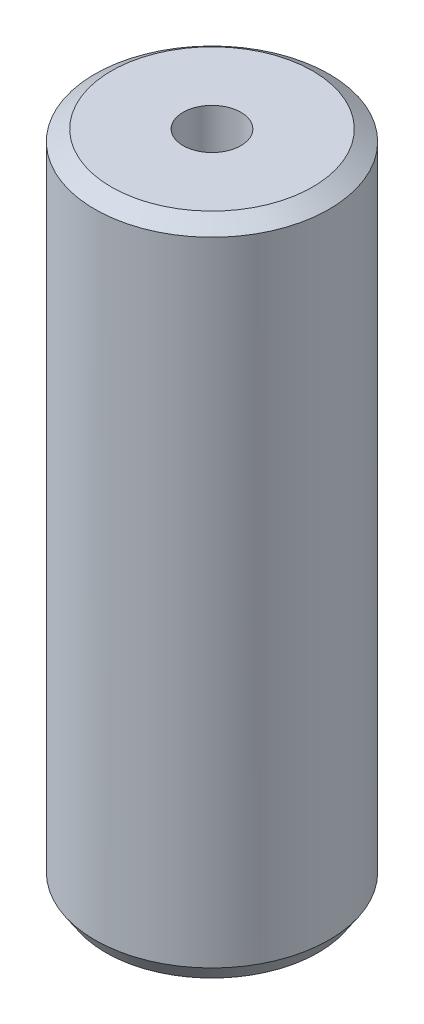
ISO-10303-21;
HEADER;
FILE_DESCRIPTION(('STEP AP214'),'2;1');
FILE_NAME('part.step','',(''),(''),'','','');
FILE_SCHEMA(('AUTOMOTIVE_DESIGN { 1 0 10303 214 1 1 1 1 }'));
ENDSEC;
DATA;
#1=APPLICATION_CONTEXT('core data for automotive mechanical design processes');
#2=APPLICATION_PROTOCOL_DEFINITION('international standard','automotive_design',2000,#1);
#3=PRODUCT_CONTEXT('',#1,'mechanical');
#4=PRODUCT('Part','Part','',(#3));
#5=PRODUCT_RELATED_PRODUCT_CATEGORY('part','',(#4));
#6=PRODUCT_DEFINITION_FORMATION('','',#4);
#7=PRODUCT_DEFINITION_CONTEXT('part definition',#1,'design');
#8=PRODUCT_DEFINITION('design','',#6,#7);
#9=PRODUCT_DEFINITION_SHAPE('','',#8);
#10=(LENGTH_UNIT() NAMED_UNIT(*) SI_UNIT(.MILLI.,.METRE.));
#11=(NAMED_UNIT(*) PLANE_ANGLE_UNIT() SI_UNIT($,.RADIAN.));
#12=(NAMED_UNIT(*) SI_UNIT($,.STERADIAN.) SOLID_ANGLE_UNIT());
#13=UNCERTAINTY_MEASURE_WITH_UNIT(LENGTH_MEASURE(1.E-05),#10,'distance_accuracy_value','');
#14=(GEOMETRIC_REPRESENTATION_CONTEXT(3) GLOBAL_UNCERTAINTY_ASSIGNED_CONTEXT((#13)) GLOBAL_UNIT_ASSIGNED_CONTEXT((#10,
#11,#12)) REPRESENTATION_CONTEXT('',''));
#15=CARTESIAN_POINT('',(0.,0.,0.));
#16=DIRECTION('',(0.,0.,1.));
#17=DIRECTION('',(1.,0.,0.));
#18=AXIS2_PLACEMENT_3D('',#15,#16,#17);
#19=CARTESIAN_POINT('',(0.,28.1818790925232,0.));
#20=DIRECTION('',(0.,-1.,0.));
#21=DIRECTION('',(0.,0.,-1.));
#22=AXIS2_PLACEMENT_3D('',#19,#20,#21);
#23=CYLINDRICAL_SURFACE('',#22,5.);
#24=CARTESIAN_POINT('',(0.,27.712683959634,0.));
#25=DIRECTION('',(0.,1.,0.));
#26=DIRECTION('',(0.,0.,1.));
#27=AXIS2_PLACEMENT_3D('',#24,#25,#26);
#28=CIRCLE('',#27,5.);
#29=CARTESIAN_POINT('',(0.,27.712683959634,-5.));
#30=VERTEX_POINT('',#29);
#31=EDGE_CURVE('E50',#30,#30,#28,.F.);
#32=ORIENTED_EDGE('',*,*,#31,.T.);
#33=EDGE_LOOP('',(#32));
#34=FACE_BOUND('',#33,.T.);
#35=CARTESIAN_POINT('',(0.,0.705002985885456,0.));
#36=DIRECTION('',(0.,1.,0.));
#37=DIRECTION('',(0.,0.,1.));
#38=AXIS2_PLACEMENT_3D('',#35,#36,#37);
#39=CIRCLE('',#38,5.);
#40=CARTESIAN_POINT('',(0.,0.705002985885456,5.));
#41=VERTEX_POINT('',#40);
#42=EDGE_CURVE('E51',#41,#41,#39,.T.);
#43=ORIENTED_EDGE('',*,*,#42,.T.);
#44=EDGE_LOOP('',(#43));
#45=FACE_BOUND('',#44,.T.);
#46=ADVANCED_FACE('F39',(#34,#45),#23,.T.);
#47=CARTESIAN_POINT('',(0.,28.1818790925232,0.));
#48=DIRECTION('',(0.,1.,0.));
#49=DIRECTION('',(0.,0.,1.));
#50=AXIS2_PLACEMENT_3D('',#47,#48,#49);
#51=PLANE('',#50);
#52=CARTESIAN_POINT('',(0.,28.1818790925232,0.));
#53=DIRECTION('',(0.,1.,0.));
#54=DIRECTION('',(0.,0.,1.));
#55=AXIS2_PLACEMENT_3D('',#52,#53,#54);
#56=CIRCLE('',#55,4.29499701411454);
#57=CARTESIAN_POINT('',(0.,28.1818790925232,-4.29499701411454));
#58=VERTEX_POINT('',#57);
#59=EDGE_CURVE('E54',#58,#58,#56,.T.);
#60=ORIENTED_EDGE('',*,*,#59,.T.);
#61=EDGE_LOOP('',(#60));
#62=FACE_BOUND('',#61,.T.);
#63=CARTESIAN_POINT('',(0.,28.1818790925232,0.));
#64=DIRECTION('',(0.,1.,0.));
#65=DIRECTION('',(0.,0.,1.));
#66=AXIS2_PLACEMENT_3D('',#63,#64,#65);
#67=CIRCLE('',#66,1.23468767665475);
#68=CARTESIAN_POINT('',(0.,28.1818790925232,1.23468767665475));
#69=VERTEX_POINT('',#68);
#70=EDGE_CURVE('E58',#69,#69,#67,.T.);
#71=ORIENTED_EDGE('',*,*,#70,.F.);
#72=EDGE_LOOP('',(#71));
#73=FACE_BOUND('',#72,.T.);
#74=ADVANCED_FACE('F69',(#62,#73),#51,.T.);
#75=CARTESIAN_POINT('',(0.,0.,0.));
#76=DIRECTION('',(0.,1.,0.));
#77=DIRECTION('',(0.,0.,1.));
#78=AXIS2_PLACEMENT_3D('',#75,#76,#77);
#79=PLANE('',#78);
#80=CARTESIAN_POINT('',(0.,0.,0.));
#81=DIRECTION('',(0.,1.,0.));
#82=DIRECTION('',(0.,0.,1.));
#83=AXIS2_PLACEMENT_3D('',#80,#81,#82);
#84=CIRCLE('',#83,4.53080486711085);
#85=CARTESIAN_POINT('',(0.,0.,4.53080486711085));
#86=VERTEX_POINT('',#85);
#87=EDGE_CURVE('E10',#86,#86,#84,.F.);
#88=ORIENTED_EDGE('',*,*,#87,.T.);
#89=EDGE_LOOP('',(#88));
#90=FACE_BOUND('',#89,.T.);
#91=CARTESIAN_POINT('',(0.,0.,0.));
#92=DIRECTION('',(0.,1.,0.));
#93=DIRECTION('',(0.,0.,1.));
#94=AXIS2_PLACEMENT_3D('',#91,#92,#93);
#95=CIRCLE('',#94,1.23468767665475);
#96=CARTESIAN_POINT('',(0.,0.,1.23468767665475));
#97=VERTEX_POINT('',#96);
#98=EDGE_CURVE('E63',#97,#97,#95,.T.);
#99=ORIENTED_EDGE('',*,*,#98,.T.);
#100=EDGE_LOOP('',(#99));
#101=FACE_BOUND('',#100,.T.);
#102=ADVANCED_FACE('F75',(#90,#101),#79,.F.);
#103=CARTESIAN_POINT('',(0.,28.1818790925232,0.));
#104=DIRECTION('',(0.,-1.,0.));
#105=DIRECTION('',(0.,0.,-1.));
#106=AXIS2_PLACEMENT_3D('',#103,#104,#105);
#107=CYLINDRICAL_SURFACE('',#106,1.23468767665475);
#108=ORIENTED_EDGE('',*,*,#70,.T.);
#109=EDGE_LOOP('',(#108));
#110=FACE_BOUND('',#109,.T.);
#111=ORIENTED_EDGE('',*,*,#98,.F.);
#112=EDGE_LOOP('',(#111));
#113=FACE_BOUND('',#112,.T.);
#114=ADVANCED_FACE('F70',(#110,#113),#107,.F.);
#115=CARTESIAN_POINT('',(0.,28.1818790925232,0.));
#116=DIRECTION('',(0.,-1.,0.));
#117=DIRECTION('',(0.,0.,-1.));
#118=AXIS2_PLACEMENT_3D('',#115,#116,#117);
#119=CONICAL_SURFACE('',#118,4.29499701411454,0.983586470090851);
#120=CARTESIAN_POINT('',(0.,27.712683959634,-5.));
#121=CARTESIAN_POINT('',(0.,27.717571408935,-4.99265621889703));
#122=CARTESIAN_POINT('',(0.,27.7224588582359,-4.98531243779406));
#123=CARTESIAN_POINT('',(0.,27.7322337568377,-4.97062487558811));
#124=CARTESIAN_POINT('',(0.,27.7371212061387,-4.96328109448514));
#125=CARTESIAN_POINT('',(0.,27.7468961047405,-4.94859353227919));
#126=CARTESIAN_POINT('',(0.,27.7517835540415,-4.94124975117621));
#127=CARTESIAN_POINT('',(0.,27.7615584526433,-4.92656218897027));
#128=CARTESIAN_POINT('',(0.,27.7664459019442,-4.91921840786729));
#129=CARTESIAN_POINT('',(0.,27.7762208005461,-4.90453084566135));
#130=CARTESIAN_POINT('',(0.,27.781108249847,-4.89718706455837));
#131=CARTESIAN_POINT('',(0.,27.7908831484489,-4.88249950235243));
#132=CARTESIAN_POINT('',(0.,27.7957705977498,-4.87515572124945));
#133=CARTESIAN_POINT('',(0.,27.8055454963517,-4.86046815904351));
#134=CARTESIAN_POINT('',(0.,27.8104329456526,-4.85312437794053));
#135=CARTESIAN_POINT('',(0.,27.8202078442545,-4.83843681573458));
#136=CARTESIAN_POINT('',(0.,27.8250952935554,-4.83109303463161));
#137=CARTESIAN_POINT('',(0.,27.8348701921572,-4.81640547242566));
#138=CARTESIAN_POINT('',(0.,27.8397576414582,-4.80906169132269));
#139=CARTESIAN_POINT('',(0.,27.84953254006,-4.79437412911674));
#140=CARTESIAN_POINT('',(0.,27.854419989361,-4.78703034801377));
#141=CARTESIAN_POINT('',(0.,27.8641948879628,-4.77234278580782));
#142=CARTESIAN_POINT('',(0.,27.8690823372637,-4.76499900470485));
#143=CARTESIAN_POINT('',(0.,27.8788572358656,-4.7503114424989));
#144=CARTESIAN_POINT('',(0.,27.8837446851665,-4.74296766139593));
#145=CARTESIAN_POINT('',(0.,27.8935195837684,-4.72828009918998));
#146=CARTESIAN_POINT('',(0.,27.8984070330693,-4.72093631808701));
#147=CARTESIAN_POINT('',(0.,27.9081819316712,-4.70624875588106));
#148=CARTESIAN_POINT('',(0.,27.9130693809721,-4.69890497477809));
#149=CARTESIAN_POINT('',(0.,27.922844279574,-4.68421741257214));
#150=CARTESIAN_POINT('',(0.,27.9277317288749,-4.67687363146917));
#151=CARTESIAN_POINT('',(0.,27.9375066274767,-4.66218606926322));
#152=CARTESIAN_POINT('',(0.,27.9423940767777,-4.65484228816025));
#153=CARTESIAN_POINT('',(0.,27.9521689753795,-4.6401547259543));
#154=CARTESIAN_POINT('',(0.,27.9570564246805,-4.63281094485133));
#155=CARTESIAN_POINT('',(0.,27.9668313232823,-4.61812338264538));
#156=CARTESIAN_POINT('',(0.,27.9717187725832,-4.61077960154241));
#157=CARTESIAN_POINT('',(0.,27.9814936711851,-4.59609203933646));
#158=CARTESIAN_POINT('',(0.,27.986381120486,-4.58874825823349));
#159=CARTESIAN_POINT('',(0.,27.9961560190879,-4.57406069602754));
#160=CARTESIAN_POINT('',(0.,28.0010434683888,-4.56671691492456));
#161=CARTESIAN_POINT('',(0.,28.0108183669907,-4.55202935271862));
#162=CARTESIAN_POINT('',(0.,28.0157058162916,-4.54468557161564));
#163=CARTESIAN_POINT('',(0.,28.0254807148935,-4.5299980094097));
#164=CARTESIAN_POINT('',(0.,28.0303681641944,-4.52265422830672));
#165=CARTESIAN_POINT('',(0.,28.0401430627962,-4.50796666610078));
#166=CARTESIAN_POINT('',(0.,28.0450305120972,-4.5006228849978));
#167=CARTESIAN_POINT('',(0.,28.054805410699,-4.48593532279186));
#168=CARTESIAN_POINT('',(0.,28.05969286,-4.47859154168888));
#169=CARTESIAN_POINT('',(0.,28.0694677586018,-4.46390397948293));
#170=CARTESIAN_POINT('',(0.,28.0743552079027,-4.45656019837996));
#171=CARTESIAN_POINT('',(0.,28.0841301065046,-4.44187263617401));
#172=CARTESIAN_POINT('',(0.,28.0890175558055,-4.43452885507104));
#173=CARTESIAN_POINT('',(0.,28.0987924544074,-4.41984129286509));
#174=CARTESIAN_POINT('',(0.,28.1036799037083,-4.41249751176212));
#175=CARTESIAN_POINT('',(0.,28.1134548023102,-4.39780994955617));
#176=CARTESIAN_POINT('',(0.,28.1183422516111,-4.3904661684532));
#177=CARTESIAN_POINT('',(0.,28.128117150213,-4.37577860624725));
#178=CARTESIAN_POINT('',(0.,28.1330045995139,-4.36843482514428));
#179=CARTESIAN_POINT('',(0.,28.1427794981158,-4.35374726293833));
#180=CARTESIAN_POINT('',(0.,28.1476669474167,-4.34640348183536));
#181=CARTESIAN_POINT('',(0.,28.1574418460185,-4.33171591962941));
#182=CARTESIAN_POINT('',(0.,28.1623292953195,-4.32437213852644));
#183=CARTESIAN_POINT('',(0.,28.1721041939213,-4.30968457632049));
#184=CARTESIAN_POINT('',(0.,28.1769916432223,-4.30234079521752));
#185=CARTESIAN_POINT('',(0.,28.1818790925232,-4.29499701411454));
#186=B_SPLINE_CURVE_WITH_KNOTS('',3,(#120,#121,#122,#123,#124,#125,#126,#127,#128,#129,#130,
#131,#132,#133,#134,#135,#136,#137,#138,#139,#140,#141,#142,#143,#144,#145,#146,#147,#148,#149,
#150,#151,#152,#153,#154,#155,#156,#157,#158,#159,#160,#161,#162,#163,#164,#165,#166,#167,#168,
#169,#170,#171,#172,#173,#174,#175,#176,#177,#178,#179,#180,#181,#182,#183,#184,#185),
.UNSPECIFIED.,.F.,.F.,(4,2,2,2,2,2,2,2,2,2,2,2,2,2,2,2,2,2,2,2,2,2,2,2,2,2,2,2,2,2,2,2,4),(0.,
0.0264644012593881,0.0529288025187749,0.0793932037781618,0.105857605037551,0.132322006296937,
0.158786407556324,0.18525080881571,0.211715210075099,0.238179611334485,0.264644012593872,
0.291108413853261,0.317572815112647,0.344037216372034,0.370501617631421,0.396966018890809,
0.423430420150196,0.449894821409582,0.476359222668971,0.502823623928358,0.529288025187744,
0.555752426447131,0.58221682770652,0.608681228965906,0.635145630225293,0.661610031484682,
0.688074432744068,0.714538834003455,0.741003235262841,0.76746763652223,0.793932037781617,
0.820396439041003,0.846860840300392),.UNSPECIFIED.);
#187=EDGE_CURVE('BSEAM81',#30,#58,#186,.T.);
#188=ORIENTED_EDGE('',*,*,#31,.F.);
#189=ORIENTED_EDGE('',*,*,#59,.F.);
#190=ORIENTED_EDGE('',*,*,#187,.T.);
#191=ORIENTED_EDGE('',*,*,#187,.F.);
#192=EDGE_LOOP('',(#188,#190,#189,#191));
#193=FACE_BOUND('',#192,.T.);
#194=ADVANCED_FACE('F81',(#193),#119,.T.);
#195=CARTESIAN_POINT('',(0.,0.705002985885456,0.));
#196=DIRECTION('',(0.,1.,0.));
#197=DIRECTION('',(0.,0.,1.));
#198=AXIS2_PLACEMENT_3D('',#195,#196,#197);
#199=CONICAL_SURFACE('',#198,5.,0.587209856704041);
#200=ORIENTED_EDGE('',*,*,#87,.F.);
#201=EDGE_LOOP('',(#200));
#202=FACE_BOUND('',#201,.T.);
#203=ORIENTED_EDGE('',*,*,#42,.F.);
#204=EDGE_LOOP('',(#203));
#205=FACE_BOUND('',#204,.T.);
#206=ADVANCED_FACE('F45',(#202,#205),#199,.T.);
#207=CLOSED_SHELL('',(#46,#74,#102,#114,#194,#206));
#208=MANIFOLD_SOLID_BREP('B2',#207);
#209=ADVANCED_BREP_SHAPE_REPRESENTATION('',(#18,#208),#14);
#210=SHAPE_DEFINITION_REPRESENTATION(#9,#209);
ENDSEC;
END-ISO-10303-21;
